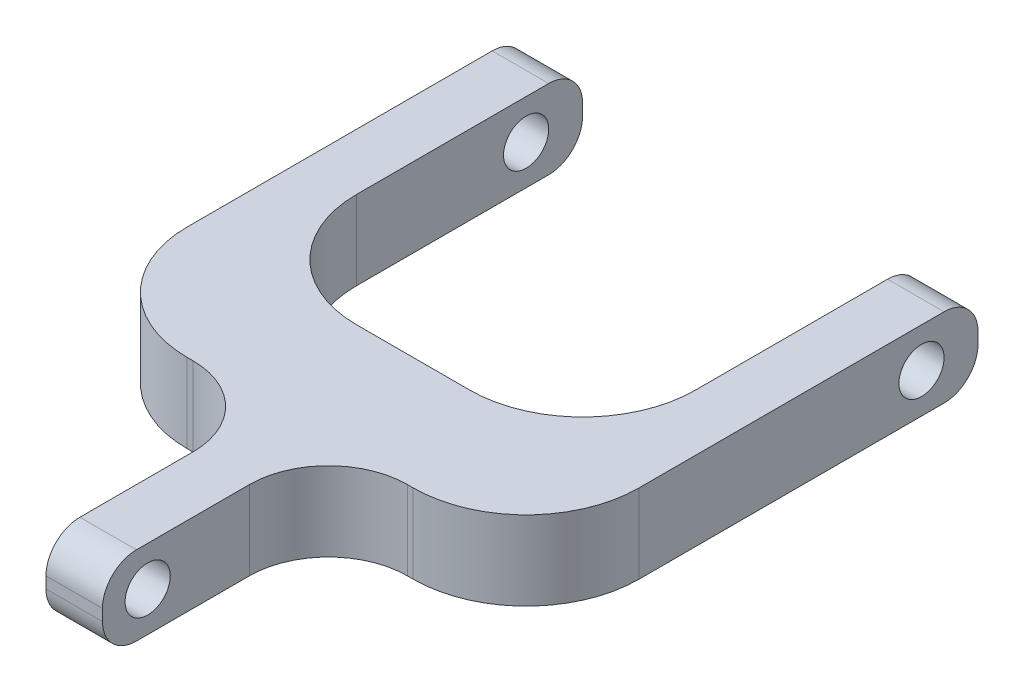
ISO-10303-21;
HEADER;
FILE_DESCRIPTION(('STEP AP214'),'2;1');
FILE_NAME('part.step','',(''),(''),'','','');
FILE_SCHEMA(('AUTOMOTIVE_DESIGN { 1 0 10303 214 1 1 1 1 }'));
ENDSEC;
DATA;
#1=APPLICATION_CONTEXT('core data for automotive mechanical design processes');
#2=APPLICATION_PROTOCOL_DEFINITION('international standard','automotive_design',2000,#1);
#3=PRODUCT_CONTEXT('',#1,'mechanical');
#4=PRODUCT('Part','Part','',(#3));
#5=PRODUCT_RELATED_PRODUCT_CATEGORY('part','',(#4));
#6=PRODUCT_DEFINITION_FORMATION('','',#4);
#7=PRODUCT_DEFINITION_CONTEXT('part definition',#1,'design');
#8=PRODUCT_DEFINITION('design','',#6,#7);
#9=PRODUCT_DEFINITION_SHAPE('','',#8);
#10=(LENGTH_UNIT() NAMED_UNIT(*) SI_UNIT(.MILLI.,.METRE.));
#11=(NAMED_UNIT(*) PLANE_ANGLE_UNIT() SI_UNIT($,.RADIAN.));
#12=(NAMED_UNIT(*) SI_UNIT($,.STERADIAN.) SOLID_ANGLE_UNIT());
#13=UNCERTAINTY_MEASURE_WITH_UNIT(LENGTH_MEASURE(1.E-05),#10,'distance_accuracy_value','');
#14=(GEOMETRIC_REPRESENTATION_CONTEXT(3) GLOBAL_UNCERTAINTY_ASSIGNED_CONTEXT((#13)) GLOBAL_UNIT_ASSIGNED_CONTEXT((#10,
#11,#12)) REPRESENTATION_CONTEXT('',''));
#15=CARTESIAN_POINT('',(0.,0.,0.));
#16=DIRECTION('',(0.,0.,1.));
#17=DIRECTION('',(1.,0.,0.));
#18=AXIS2_PLACEMENT_3D('',#15,#16,#17);
#19=CARTESIAN_POINT('',(40.,3.5,20.));
#20=DIRECTION('',(0.,0.,-1.));
#21=DIRECTION('',(-1.,0.,0.));
#22=AXIS2_PLACEMENT_3D('',#19,#20,#21);
#23=PLANE('',#22);
#24=DIRECTION('',(-1.,0.,0.));
#25=VECTOR('',#24,1.);
#26=CARTESIAN_POINT('',(40.,-3.5,20.));
#27=LINE('',#26,#25);
#28=CARTESIAN_POINT('',(10.5,-3.5,20.));
#29=VERTEX_POINT('',#28);
#30=CARTESIAN_POINT('',(10.,-3.5,20.));
#31=VERTEX_POINT('',#30);
#32=EDGE_CURVE('E291',#29,#31,#27,.T.);
#33=ORIENTED_EDGE('',*,*,#32,.F.);
#34=DIRECTION('',(0.,-1.,0.));
#35=VECTOR('',#34,1.);
#36=CARTESIAN_POINT('',(10.5,3.5,20.));
#37=LINE('',#36,#35);
#38=CARTESIAN_POINT('',(10.5,3.5,20.));
#39=VERTEX_POINT('',#38);
#40=EDGE_CURVE('E349',#29,#39,#37,.F.);
#41=ORIENTED_EDGE('',*,*,#40,.T.);
#42=DIRECTION('',(-1.,0.,0.));
#43=VECTOR('',#42,1.);
#44=CARTESIAN_POINT('',(40.,3.5,20.));
#45=LINE('',#44,#43);
#46=CARTESIAN_POINT('',(10.,3.5,20.));
#47=VERTEX_POINT('',#46);
#48=EDGE_CURVE('E304',#39,#47,#45,.T.);
#49=ORIENTED_EDGE('',*,*,#48,.T.);
#50=DIRECTION('',(0.,-1.,0.));
#51=VECTOR('',#50,1.);
#52=CARTESIAN_POINT('',(10.,3.5,20.));
#53=LINE('',#52,#51);
#54=EDGE_CURVE('E319',#47,#31,#53,.T.);
#55=ORIENTED_EDGE('',*,*,#54,.T.);
#56=EDGE_LOOP('',(#33,#41,#49,#55));
#57=FACE_BOUND('',#56,.T.);
#58=ADVANCED_FACE('F42',(#57),#23,.F.);
#59=CARTESIAN_POINT('',(30.,3.5,20.));
#60=VERTEX_POINT('',#59);
#61=CARTESIAN_POINT('',(29.5,3.5,20.));
#62=VERTEX_POINT('',#61);
#63=EDGE_CURVE('E305',#60,#62,#45,.T.);
#64=ORIENTED_EDGE('',*,*,#63,.T.);
#65=DIRECTION('',(0.,1.,0.));
#66=VECTOR('',#65,1.);
#67=CARTESIAN_POINT('',(29.5,-3.5,20.));
#68=LINE('',#67,#66);
#69=CARTESIAN_POINT('',(29.5,-3.5,20.));
#70=VERTEX_POINT('',#69);
#71=EDGE_CURVE('E342',#62,#70,#68,.F.);
#72=ORIENTED_EDGE('',*,*,#71,.T.);
#73=CARTESIAN_POINT('',(30.,-3.5,20.));
#74=VERTEX_POINT('',#73);
#75=EDGE_CURVE('E300',#74,#70,#27,.T.);
#76=ORIENTED_EDGE('',*,*,#75,.F.);
#77=DIRECTION('',(0.,-1.,0.));
#78=VECTOR('',#77,1.);
#79=CARTESIAN_POINT('',(30.,3.5,20.));
#80=LINE('',#79,#78);
#81=EDGE_CURVE('E323',#74,#60,#80,.F.);
#82=ORIENTED_EDGE('',*,*,#81,.T.);
#83=EDGE_LOOP('',(#64,#72,#76,#82));
#84=FACE_BOUND('',#83,.T.);
#85=ADVANCED_FACE('F476',(#84),#23,.F.);
#86=CARTESIAN_POINT('',(40.,3.5,-20.));
#87=DIRECTION('',(0.,0.,1.));
#88=DIRECTION('',(1.,0.,0.));
#89=AXIS2_PLACEMENT_3D('',#86,#87,#88);
#90=PLANE('',#89);
#91=DIRECTION('',(0.,1.,0.));
#92=VECTOR('',#91,1.);
#93=CARTESIAN_POINT('',(5.,-3.5,-20.));
#94=LINE('',#93,#92);
#95=CARTESIAN_POINT('',(5.,-0.5,-20.));
#96=VERTEX_POINT('',#95);
#97=CARTESIAN_POINT('',(5.,0.5,-20.));
#98=VERTEX_POINT('',#97);
#99=EDGE_CURVE('E265',#96,#98,#94,.T.);
#100=ORIENTED_EDGE('',*,*,#99,.F.);
#101=DIRECTION('',(-1.,0.,0.));
#102=VECTOR('',#101,1.);
#103=CARTESIAN_POINT('',(40.,-0.5,-20.));
#104=LINE('',#103,#102);
#105=CARTESIAN_POINT('',(0.,-0.5,-20.));
#106=VERTEX_POINT('',#105);
#107=EDGE_CURVE('E408',#96,#106,#104,.T.);
#108=ORIENTED_EDGE('',*,*,#107,.T.);
#109=DIRECTION('',(0.,1.,0.));
#110=VECTOR('',#109,1.);
#111=CARTESIAN_POINT('',(0.,3.5,-20.));
#112=LINE('',#111,#110);
#113=CARTESIAN_POINT('',(0.,0.5,-20.));
#114=VERTEX_POINT('',#113);
#115=EDGE_CURVE('E269',#106,#114,#112,.T.);
#116=ORIENTED_EDGE('',*,*,#115,.T.);
#117=DIRECTION('',(-1.,0.,0.));
#118=VECTOR('',#117,1.);
#119=CARTESIAN_POINT('',(40.,0.5,-20.));
#120=LINE('',#119,#118);
#121=EDGE_CURVE('E405',#114,#98,#120,.F.);
#122=ORIENTED_EDGE('',*,*,#121,.T.);
#123=EDGE_LOOP('',(#100,#108,#116,#122));
#124=FACE_BOUND('',#123,.T.);
#125=ADVANCED_FACE('F482',(#124),#90,.F.);
#126=DIRECTION('',(0.,1.,0.));
#127=VECTOR('',#126,1.);
#128=CARTESIAN_POINT('',(40.,3.5,-20.));
#129=LINE('',#128,#127);
#130=CARTESIAN_POINT('',(40.,-0.5,-20.));
#131=VERTEX_POINT('',#130);
#132=CARTESIAN_POINT('',(40.,0.5,-20.));
#133=VERTEX_POINT('',#132);
#134=EDGE_CURVE('E281',#131,#133,#129,.T.);
#135=ORIENTED_EDGE('',*,*,#134,.F.);
#136=DIRECTION('',(-1.,0.,0.));
#137=VECTOR('',#136,1.);
#138=CARTESIAN_POINT('',(40.,-0.5,-20.));
#139=LINE('',#138,#137);
#140=CARTESIAN_POINT('',(35.,-0.5,-20.));
#141=VERTEX_POINT('',#140);
#142=EDGE_CURVE('E426',#131,#141,#139,.T.);
#143=ORIENTED_EDGE('',*,*,#142,.T.);
#144=DIRECTION('',(0.,1.,0.));
#145=VECTOR('',#144,1.);
#146=CARTESIAN_POINT('',(35.,-3.5,-20.));
#147=LINE('',#146,#145);
#148=CARTESIAN_POINT('',(35.,0.5,-20.));
#149=VERTEX_POINT('',#148);
#150=EDGE_CURVE('E270',#141,#149,#147,.T.);
#151=ORIENTED_EDGE('',*,*,#150,.T.);
#152=DIRECTION('',(-1.,0.,0.));
#153=VECTOR('',#152,1.);
#154=CARTESIAN_POINT('',(40.,0.5,-20.));
#155=LINE('',#154,#153);
#156=EDGE_CURVE('E59',#149,#133,#155,.F.);
#157=ORIENTED_EDGE('',*,*,#156,.T.);
#158=EDGE_LOOP('',(#135,#143,#151,#157));
#159=FACE_BOUND('',#158,.T.);
#160=ADVANCED_FACE('F452',(#159),#90,.F.);
#161=CARTESIAN_POINT('',(40.,3.5,20.));
#162=DIRECTION('',(0.,-1.,0.));
#163=DIRECTION('',(0.,0.,-1.));
#164=AXIS2_PLACEMENT_3D('',#161,#162,#163);
#165=PLANE('',#164);
#166=DIRECTION('',(0.,0.,-1.));
#167=VECTOR('',#166,1.);
#168=CARTESIAN_POINT('',(17.5,3.5,40.));
#169=LINE('',#168,#167);
#170=CARTESIAN_POINT('',(17.5,3.5,37.));
#171=VERTEX_POINT('',#170);
#172=CARTESIAN_POINT('',(17.5,3.5,27.));
#173=VERTEX_POINT('',#172);
#174=EDGE_CURVE('E590',#171,#173,#169,.T.);
#175=ORIENTED_EDGE('',*,*,#174,.F.);
#176=DIRECTION('',(-1.,0.,0.));
#177=VECTOR('',#176,1.);
#178=CARTESIAN_POINT('',(22.5,3.5,37.));
#179=LINE('',#178,#177);
#180=CARTESIAN_POINT('',(22.5,3.5,37.));
#181=VERTEX_POINT('',#180);
#182=EDGE_CURVE('E402',#171,#181,#179,.F.);
#183=ORIENTED_EDGE('',*,*,#182,.T.);
#184=DIRECTION('',(0.,0.,-1.));
#185=VECTOR('',#184,1.);
#186=CARTESIAN_POINT('',(22.5,3.5,40.));
#187=LINE('',#186,#185);
#188=CARTESIAN_POINT('',(22.5,3.5,27.));
#189=VERTEX_POINT('',#188);
#190=EDGE_CURVE('E593',#181,#189,#187,.T.);
#191=ORIENTED_EDGE('',*,*,#190,.T.);
#192=CARTESIAN_POINT('',(29.5,3.5,27.));
#193=DIRECTION('',(0.,-1.,0.));
#194=DIRECTION('',(0.,0.,-1.));
#195=AXIS2_PLACEMENT_3D('',#192,#193,#194);
#196=CIRCLE('',#195,7.);
#197=EDGE_CURVE('E352',#189,#62,#196,.T.);
#198=ORIENTED_EDGE('',*,*,#197,.T.);
#199=ORIENTED_EDGE('',*,*,#63,.F.);
#200=CARTESIAN_POINT('',(30.,3.5,10.));
#201=DIRECTION('',(0.,-1.,0.));
#202=DIRECTION('',(0.,0.,-1.));
#203=AXIS2_PLACEMENT_3D('',#200,#201,#202);
#204=CIRCLE('',#203,10.);
#205=CARTESIAN_POINT('',(40.,3.5,10.));
#206=VERTEX_POINT('',#205);
#207=EDGE_CURVE('E330',#60,#206,#204,.F.);
#208=ORIENTED_EDGE('',*,*,#207,.T.);
#209=DIRECTION('',(0.,0.,1.));
#210=VECTOR('',#209,1.);
#211=CARTESIAN_POINT('',(40.,3.5,20.));
#212=LINE('',#211,#210);
#213=CARTESIAN_POINT('',(40.,3.5,-17.));
#214=VERTEX_POINT('',#213);
#215=EDGE_CURVE('E284',#214,#206,#212,.T.);
#216=ORIENTED_EDGE('',*,*,#215,.F.);
#217=DIRECTION('',(-1.,0.,0.));
#218=VECTOR('',#217,1.);
#219=CARTESIAN_POINT('',(40.,3.5,-17.));
#220=LINE('',#219,#218);
#221=CARTESIAN_POINT('',(35.,3.5,-17.));
#222=VERTEX_POINT('',#221);
#223=EDGE_CURVE('E394',#214,#222,#220,.T.);
#224=ORIENTED_EDGE('',*,*,#223,.T.);
#225=DIRECTION('',(0.,0.,-1.));
#226=VECTOR('',#225,1.);
#227=CARTESIAN_POINT('',(35.,3.5,-20.));
#228=LINE('',#227,#226);
#229=CARTESIAN_POINT('',(35.,3.5,0.));
#230=VERTEX_POINT('',#229);
#231=EDGE_CURVE('E218',#230,#222,#228,.T.);
#232=ORIENTED_EDGE('',*,*,#231,.F.);
#233=CARTESIAN_POINT('',(25.,3.5,0.));
#234=DIRECTION('',(0.,1.,0.));
#235=DIRECTION('',(0.,0.,1.));
#236=AXIS2_PLACEMENT_3D('',#233,#234,#235);
#237=CIRCLE('',#236,10.);
#238=CARTESIAN_POINT('',(25.,3.5,10.));
#239=VERTEX_POINT('',#238);
#240=EDGE_CURVE('E258',#239,#230,#237,.T.);
#241=ORIENTED_EDGE('',*,*,#240,.F.);
#242=DIRECTION('',(1.,0.,0.));
#243=VECTOR('',#242,1.);
#244=CARTESIAN_POINT('',(15.,3.5,10.));
#245=LINE('',#244,#243);
#246=CARTESIAN_POINT('',(15.,3.5,10.));
#247=VERTEX_POINT('',#246);
#248=EDGE_CURVE('E254',#247,#239,#245,.T.);
#249=ORIENTED_EDGE('',*,*,#248,.F.);
#250=CARTESIAN_POINT('',(15.,3.5,0.));
#251=DIRECTION('',(0.,1.,0.));
#252=DIRECTION('',(0.,0.,1.));
#253=AXIS2_PLACEMENT_3D('',#250,#251,#252);
#254=CIRCLE('',#253,10.);
#255=CARTESIAN_POINT('',(5.,3.5,0.));
#256=VERTEX_POINT('',#255);
#257=EDGE_CURVE('E250',#256,#247,#254,.T.);
#258=ORIENTED_EDGE('',*,*,#257,.F.);
#259=DIRECTION('',(0.,0.,1.));
#260=VECTOR('',#259,1.);
#261=CARTESIAN_POINT('',(5.,3.5,-20.));
#262=LINE('',#261,#260);
#263=CARTESIAN_POINT('',(5.,3.5,-17.));
#264=VERTEX_POINT('',#263);
#265=EDGE_CURVE('E224',#264,#256,#262,.T.);
#266=ORIENTED_EDGE('',*,*,#265,.F.);
#267=DIRECTION('',(-1.,0.,0.));
#268=VECTOR('',#267,1.);
#269=CARTESIAN_POINT('',(40.,3.5,-17.));
#270=LINE('',#269,#268);
#271=CARTESIAN_POINT('',(0.,3.5,-17.));
#272=VERTEX_POINT('',#271);
#273=EDGE_CURVE('E398',#264,#272,#270,.T.);
#274=ORIENTED_EDGE('',*,*,#273,.T.);
#275=DIRECTION('',(0.,0.,1.));
#276=VECTOR('',#275,1.);
#277=CARTESIAN_POINT('',(0.,3.5,20.));
#278=LINE('',#277,#276);
#279=CARTESIAN_POINT('',(0.,3.5,10.));
#280=VERTEX_POINT('',#279);
#281=EDGE_CURVE('E295',#272,#280,#278,.T.);
#282=ORIENTED_EDGE('',*,*,#281,.T.);
#283=CARTESIAN_POINT('',(10.,3.5,10.));
#284=DIRECTION('',(0.,-1.,0.));
#285=DIRECTION('',(0.,0.,-1.));
#286=AXIS2_PLACEMENT_3D('',#283,#284,#285);
#287=CIRCLE('',#286,10.);
#288=EDGE_CURVE('E326',#280,#47,#287,.F.);
#289=ORIENTED_EDGE('',*,*,#288,.T.);
#290=ORIENTED_EDGE('',*,*,#48,.F.);
#291=CARTESIAN_POINT('',(10.5,3.5,27.));
#292=DIRECTION('',(0.,-1.,0.));
#293=DIRECTION('',(0.,0.,-1.));
#294=AXIS2_PLACEMENT_3D('',#291,#292,#293);
#295=CIRCLE('',#294,7.);
#296=EDGE_CURVE('E362',#39,#173,#295,.T.);
#297=ORIENTED_EDGE('',*,*,#296,.T.);
#298=EDGE_LOOP('',(#175,#183,#191,#198,#199,#208,#216,#224,#232,#241,#249,#258,#266,#274,#282,
#289,#290,#297));
#299=FACE_BOUND('',#298,.T.);
#300=ADVANCED_FACE('F444',(#299),#165,.F.);
#301=CARTESIAN_POINT('',(40.,-3.5,20.));
#302=DIRECTION('',(0.,1.,0.));
#303=DIRECTION('',(0.,0.,1.));
#304=AXIS2_PLACEMENT_3D('',#301,#302,#303);
#305=PLANE('',#304);
#306=DIRECTION('',(0.,0.,-1.));
#307=VECTOR('',#306,1.);
#308=CARTESIAN_POINT('',(22.5,-3.5,40.));
#309=LINE('',#308,#307);
#310=CARTESIAN_POINT('',(22.5,-3.5,37.));
#311=VERTEX_POINT('',#310);
#312=CARTESIAN_POINT('',(22.5,-3.5,27.));
#313=VERTEX_POINT('',#312);
#314=EDGE_CURVE('E596',#311,#313,#309,.T.);
#315=ORIENTED_EDGE('',*,*,#314,.F.);
#316=DIRECTION('',(1.,0.,0.));
#317=VECTOR('',#316,1.);
#318=CARTESIAN_POINT('',(17.5,-3.5,37.));
#319=LINE('',#318,#317);
#320=CARTESIAN_POINT('',(17.5,-3.5,37.));
#321=VERTEX_POINT('',#320);
#322=EDGE_CURVE('E385',#311,#321,#319,.F.);
#323=ORIENTED_EDGE('',*,*,#322,.T.);
#324=DIRECTION('',(0.,0.,-1.));
#325=VECTOR('',#324,1.);
#326=CARTESIAN_POINT('',(17.5,-3.5,40.));
#327=LINE('',#326,#325);
#328=CARTESIAN_POINT('',(17.5,-3.5,27.));
#329=VERTEX_POINT('',#328);
#330=EDGE_CURVE('E251',#321,#329,#327,.T.);
#331=ORIENTED_EDGE('',*,*,#330,.T.);
#332=CARTESIAN_POINT('',(10.5,-3.5,27.));
#333=DIRECTION('',(0.,1.,0.));
#334=DIRECTION('',(0.,0.,1.));
#335=AXIS2_PLACEMENT_3D('',#332,#333,#334);
#336=CIRCLE('',#335,7.);
#337=EDGE_CURVE('E359',#329,#29,#336,.T.);
#338=ORIENTED_EDGE('',*,*,#337,.T.);
#339=ORIENTED_EDGE('',*,*,#32,.T.);
#340=CARTESIAN_POINT('',(10.,-3.5,10.));
#341=DIRECTION('',(0.,1.,0.));
#342=DIRECTION('',(0.,0.,1.));
#343=AXIS2_PLACEMENT_3D('',#340,#341,#342);
#344=CIRCLE('',#343,10.);
#345=CARTESIAN_POINT('',(0.,-3.5,10.));
#346=VERTEX_POINT('',#345);
#347=EDGE_CURVE('E313',#31,#346,#344,.F.);
#348=ORIENTED_EDGE('',*,*,#347,.T.);
#349=DIRECTION('',(0.,0.,-1.));
#350=VECTOR('',#349,1.);
#351=CARTESIAN_POINT('',(0.,-3.5,20.));
#352=LINE('',#351,#350);
#353=CARTESIAN_POINT('',(0.,-3.5,-17.));
#354=VERTEX_POINT('',#353);
#355=EDGE_CURVE('E285',#346,#354,#352,.T.);
#356=ORIENTED_EDGE('',*,*,#355,.T.);
#357=DIRECTION('',(-1.,0.,0.));
#358=VECTOR('',#357,1.);
#359=CARTESIAN_POINT('',(40.,-3.5,-17.));
#360=LINE('',#359,#358);
#361=CARTESIAN_POINT('',(5.,-3.5,-17.));
#362=VERTEX_POINT('',#361);
#363=EDGE_CURVE('E214',#354,#362,#360,.F.);
#364=ORIENTED_EDGE('',*,*,#363,.T.);
#365=DIRECTION('',(0.,0.,1.));
#366=VECTOR('',#365,1.);
#367=CARTESIAN_POINT('',(5.,-3.5,-20.));
#368=LINE('',#367,#366);
#369=CARTESIAN_POINT('',(5.,-3.5,0.));
#370=VERTEX_POINT('',#369);
#371=EDGE_CURVE('E205',#362,#370,#368,.T.);
#372=ORIENTED_EDGE('',*,*,#371,.T.);
#373=CARTESIAN_POINT('',(15.,-3.5,0.));
#374=DIRECTION('',(0.,1.,0.));
#375=DIRECTION('',(0.,0.,1.));
#376=AXIS2_PLACEMENT_3D('',#373,#374,#375);
#377=CIRCLE('',#376,10.);
#378=CARTESIAN_POINT('',(15.,-3.5,10.));
#379=VERTEX_POINT('',#378);
#380=EDGE_CURVE('E211',#370,#379,#377,.T.);
#381=ORIENTED_EDGE('',*,*,#380,.T.);
#382=DIRECTION('',(1.,0.,0.));
#383=VECTOR('',#382,1.);
#384=CARTESIAN_POINT('',(15.,-3.5,10.));
#385=LINE('',#384,#383);
#386=CARTESIAN_POINT('',(25.,-3.5,10.));
#387=VERTEX_POINT('',#386);
#388=EDGE_CURVE('E235',#379,#387,#385,.T.);
#389=ORIENTED_EDGE('',*,*,#388,.T.);
#390=CARTESIAN_POINT('',(25.,-3.5,0.));
#391=DIRECTION('',(0.,1.,0.));
#392=DIRECTION('',(0.,0.,1.));
#393=AXIS2_PLACEMENT_3D('',#390,#391,#392);
#394=CIRCLE('',#393,10.);
#395=CARTESIAN_POINT('',(35.,-3.5,0.));
#396=VERTEX_POINT('',#395);
#397=EDGE_CURVE('E238',#387,#396,#394,.T.);
#398=ORIENTED_EDGE('',*,*,#397,.T.);
#399=DIRECTION('',(0.,0.,-1.));
#400=VECTOR('',#399,1.);
#401=CARTESIAN_POINT('',(35.,-3.5,-20.));
#402=LINE('',#401,#400);
#403=CARTESIAN_POINT('',(35.,-3.5,-17.));
#404=VERTEX_POINT('',#403);
#405=EDGE_CURVE('E230',#396,#404,#402,.T.);
#406=ORIENTED_EDGE('',*,*,#405,.T.);
#407=DIRECTION('',(-1.,0.,0.));
#408=VECTOR('',#407,1.);
#409=CARTESIAN_POINT('',(40.,-3.5,-17.));
#410=LINE('',#409,#408);
#411=CARTESIAN_POINT('',(40.,-3.5,-17.));
#412=VERTEX_POINT('',#411);
#413=EDGE_CURVE('E380',#404,#412,#410,.F.);
#414=ORIENTED_EDGE('',*,*,#413,.T.);
#415=DIRECTION('',(0.,0.,-1.));
#416=VECTOR('',#415,1.);
#417=CARTESIAN_POINT('',(40.,-3.5,20.));
#418=LINE('',#417,#416);
#419=CARTESIAN_POINT('',(40.,-3.5,10.));
#420=VERTEX_POINT('',#419);
#421=EDGE_CURVE('E288',#420,#412,#418,.T.);
#422=ORIENTED_EDGE('',*,*,#421,.F.);
#423=CARTESIAN_POINT('',(30.,-3.5,10.));
#424=DIRECTION('',(0.,1.,0.));
#425=DIRECTION('',(0.,0.,1.));
#426=AXIS2_PLACEMENT_3D('',#423,#424,#425);
#427=CIRCLE('',#426,10.);
#428=EDGE_CURVE('E316',#420,#74,#427,.F.);
#429=ORIENTED_EDGE('',*,*,#428,.T.);
#430=ORIENTED_EDGE('',*,*,#75,.T.);
#431=CARTESIAN_POINT('',(29.5,-3.5,27.));
#432=DIRECTION('',(0.,1.,0.));
#433=DIRECTION('',(0.,0.,1.));
#434=AXIS2_PLACEMENT_3D('',#431,#432,#433);
#435=CIRCLE('',#434,7.);
#436=EDGE_CURVE('E355',#70,#313,#435,.T.);
#437=ORIENTED_EDGE('',*,*,#436,.T.);
#438=EDGE_LOOP('',(#315,#323,#331,#338,#339,#348,#356,#364,#372,#381,#389,#398,#406,#414,#422,
#429,#430,#437));
#439=FACE_BOUND('',#438,.T.);
#440=ADVANCED_FACE('F208',(#439),#305,.F.);
#441=CARTESIAN_POINT('',(40.,0.,0.));
#442=DIRECTION('',(1.,0.,0.));
#443=DIRECTION('',(0.,0.,-1.));
#444=AXIS2_PLACEMENT_3D('',#441,#442,#443);
#445=PLANE('',#444);
#446=CARTESIAN_POINT('',(40.,0.,-15.));
#447=DIRECTION('',(1.,0.,0.));
#448=DIRECTION('',(0.,0.,-1.));
#449=AXIS2_PLACEMENT_3D('',#446,#447,#448);
#450=CIRCLE('',#449,2.);
#451=CARTESIAN_POINT('',(40.,0.,-17.));
#452=VERTEX_POINT('',#451);
#453=EDGE_CURVE('E573',#452,#452,#450,.T.);
#454=ORIENTED_EDGE('',*,*,#453,.F.);
#455=EDGE_LOOP('',(#454));
#456=FACE_BOUND('',#455,.T.);
#457=ORIENTED_EDGE('',*,*,#421,.T.);
#458=CARTESIAN_POINT('',(40.,-0.5,-17.));
#459=DIRECTION('',(1.,0.,0.));
#460=DIRECTION('',(0.,0.,-1.));
#461=AXIS2_PLACEMENT_3D('',#458,#459,#460);
#462=CIRCLE('',#461,3.);
#463=EDGE_CURVE('E11',#412,#131,#462,.T.);
#464=ORIENTED_EDGE('',*,*,#463,.T.);
#465=ORIENTED_EDGE('',*,*,#134,.T.);
#466=CARTESIAN_POINT('',(40.,0.5,-17.));
#467=DIRECTION('',(1.,0.,0.));
#468=DIRECTION('',(0.,0.,-1.));
#469=AXIS2_PLACEMENT_3D('',#466,#467,#468);
#470=CIRCLE('',#469,3.);
#471=EDGE_CURVE('E52',#133,#214,#470,.T.);
#472=ORIENTED_EDGE('',*,*,#471,.T.);
#473=ORIENTED_EDGE('',*,*,#215,.T.);
#474=DIRECTION('',(0.,-1.,0.));
#475=VECTOR('',#474,1.);
#476=CARTESIAN_POINT('',(40.,-3.5,10.));
#477=LINE('',#476,#475);
#478=EDGE_CURVE('E309',#206,#420,#477,.T.);
#479=ORIENTED_EDGE('',*,*,#478,.T.);
#480=EDGE_LOOP('',(#457,#464,#465,#472,#473,#479));
#481=FACE_BOUND('',#480,.T.);
#482=ADVANCED_FACE('F439',(#456,#481),#445,.T.);
#483=CARTESIAN_POINT('',(0.,0.,0.));
#484=DIRECTION('',(1.,0.,0.));
#485=DIRECTION('',(0.,0.,-1.));
#486=AXIS2_PLACEMENT_3D('',#483,#484,#485);
#487=PLANE('',#486);
#488=CARTESIAN_POINT('',(0.,0.,-15.));
#489=DIRECTION('',(1.,0.,0.));
#490=DIRECTION('',(0.,0.,-1.));
#491=AXIS2_PLACEMENT_3D('',#488,#489,#490);
#492=CIRCLE('',#491,2.);
#493=CARTESIAN_POINT('',(0.,0.,-17.));
#494=VERTEX_POINT('',#493);
#495=EDGE_CURVE('E566',#494,#494,#492,.T.);
#496=ORIENTED_EDGE('',*,*,#495,.T.);
#497=EDGE_LOOP('',(#496));
#498=FACE_BOUND('',#497,.T.);
#499=ORIENTED_EDGE('',*,*,#115,.F.);
#500=CARTESIAN_POINT('',(0.,-0.5,-17.));
#501=DIRECTION('',(1.,0.,0.));
#502=DIRECTION('',(0.,0.,-1.));
#503=AXIS2_PLACEMENT_3D('',#500,#501,#502);
#504=CIRCLE('',#503,3.);
#505=EDGE_CURVE('E415',#106,#354,#504,.F.);
#506=ORIENTED_EDGE('',*,*,#505,.T.);
#507=ORIENTED_EDGE('',*,*,#355,.F.);
#508=DIRECTION('',(0.,-1.,0.));
#509=VECTOR('',#508,1.);
#510=CARTESIAN_POINT('',(0.,0.,10.));
#511=LINE('',#510,#509);
#512=EDGE_CURVE('E334',#346,#280,#511,.F.);
#513=ORIENTED_EDGE('',*,*,#512,.T.);
#514=ORIENTED_EDGE('',*,*,#281,.F.);
#515=CARTESIAN_POINT('',(0.,0.5,-17.));
#516=DIRECTION('',(1.,0.,0.));
#517=DIRECTION('',(0.,0.,-1.));
#518=AXIS2_PLACEMENT_3D('',#515,#516,#517);
#519=CIRCLE('',#518,3.);
#520=EDGE_CURVE('E412',#272,#114,#519,.F.);
#521=ORIENTED_EDGE('',*,*,#520,.T.);
#522=EDGE_LOOP('',(#499,#506,#507,#513,#514,#521));
#523=FACE_BOUND('',#522,.T.);
#524=ADVANCED_FACE('F559',(#498,#523),#487,.F.);
#525=CARTESIAN_POINT('',(5.,-3.5,-20.));
#526=DIRECTION('',(-1.,0.,0.));
#527=DIRECTION('',(0.,0.,1.));
#528=AXIS2_PLACEMENT_3D('',#525,#526,#527);
#529=PLANE('',#528);
#530=CARTESIAN_POINT('',(5.,0.,-15.));
#531=DIRECTION('',(-1.,0.,0.));
#532=DIRECTION('',(0.,0.,1.));
#533=AXIS2_PLACEMENT_3D('',#530,#531,#532);
#534=CIRCLE('',#533,2.);
#535=CARTESIAN_POINT('',(5.,0.,-13.));
#536=VERTEX_POINT('',#535);
#537=EDGE_CURVE('E565',#536,#536,#534,.T.);
#538=ORIENTED_EDGE('',*,*,#537,.T.);
#539=EDGE_LOOP('',(#538));
#540=FACE_BOUND('',#539,.T.);
#541=ORIENTED_EDGE('',*,*,#371,.F.);
#542=CARTESIAN_POINT('',(5.,-0.5,-17.));
#543=DIRECTION('',(-1.,0.,0.));
#544=DIRECTION('',(0.,0.,1.));
#545=AXIS2_PLACEMENT_3D('',#542,#543,#544);
#546=CIRCLE('',#545,3.);
#547=EDGE_CURVE('E421',#362,#96,#546,.F.);
#548=ORIENTED_EDGE('',*,*,#547,.T.);
#549=ORIENTED_EDGE('',*,*,#99,.T.);
#550=CARTESIAN_POINT('',(5.,0.5,-17.));
#551=DIRECTION('',(-1.,0.,0.));
#552=DIRECTION('',(0.,0.,1.));
#553=AXIS2_PLACEMENT_3D('',#550,#551,#552);
#554=CIRCLE('',#553,3.);
#555=EDGE_CURVE('E418',#98,#264,#554,.F.);
#556=ORIENTED_EDGE('',*,*,#555,.T.);
#557=ORIENTED_EDGE('',*,*,#265,.T.);
#558=DIRECTION('',(0.,1.,0.));
#559=VECTOR('',#558,1.);
#560=CARTESIAN_POINT('',(5.,-3.5,0.));
#561=LINE('',#560,#559);
#562=EDGE_CURVE('E221',#370,#256,#561,.T.);
#563=ORIENTED_EDGE('',*,*,#562,.F.);
#564=EDGE_LOOP('',(#541,#548,#549,#556,#557,#563));
#565=FACE_BOUND('',#564,.T.);
#566=ADVANCED_FACE('F222',(#540,#565),#529,.F.);
#567=CARTESIAN_POINT('',(35.,-3.5,-20.));
#568=DIRECTION('',(1.,0.,0.));
#569=DIRECTION('',(0.,0.,-1.));
#570=AXIS2_PLACEMENT_3D('',#567,#568,#569);
#571=PLANE('',#570);
#572=CARTESIAN_POINT('',(35.,0.,-15.));
#573=DIRECTION('',(1.,0.,0.));
#574=DIRECTION('',(0.,0.,-1.));
#575=AXIS2_PLACEMENT_3D('',#572,#573,#574);
#576=CIRCLE('',#575,2.);
#577=CARTESIAN_POINT('',(35.,0.,-17.));
#578=VERTEX_POINT('',#577);
#579=EDGE_CURVE('E46',#578,#578,#576,.T.);
#580=ORIENTED_EDGE('',*,*,#579,.T.);
#581=EDGE_LOOP('',(#580));
#582=FACE_BOUND('',#581,.T.);
#583=ORIENTED_EDGE('',*,*,#150,.F.);
#584=CARTESIAN_POINT('',(35.,-0.5,-17.));
#585=DIRECTION('',(1.,0.,0.));
#586=DIRECTION('',(0.,0.,-1.));
#587=AXIS2_PLACEMENT_3D('',#584,#585,#586);
#588=CIRCLE('',#587,3.);
#589=EDGE_CURVE('E433',#141,#404,#588,.F.);
#590=ORIENTED_EDGE('',*,*,#589,.T.);
#591=ORIENTED_EDGE('',*,*,#405,.F.);
#592=DIRECTION('',(0.,1.,0.));
#593=VECTOR('',#592,1.);
#594=CARTESIAN_POINT('',(35.,-3.5,0.));
#595=LINE('',#594,#593);
#596=EDGE_CURVE('E273',#396,#230,#595,.T.);
#597=ORIENTED_EDGE('',*,*,#596,.T.);
#598=ORIENTED_EDGE('',*,*,#231,.T.);
#599=CARTESIAN_POINT('',(35.,0.5,-17.));
#600=DIRECTION('',(1.,0.,0.));
#601=DIRECTION('',(0.,0.,-1.));
#602=AXIS2_PLACEMENT_3D('',#599,#600,#601);
#603=CIRCLE('',#602,3.);
#604=EDGE_CURVE('E430',#222,#149,#603,.F.);
#605=ORIENTED_EDGE('',*,*,#604,.T.);
#606=EDGE_LOOP('',(#583,#590,#591,#597,#598,#605));
#607=FACE_BOUND('',#606,.T.);
#608=ADVANCED_FACE('F451',(#582,#607),#571,.F.);
#609=CARTESIAN_POINT('',(25.,-3.5,0.));
#610=DIRECTION('',(0.,1.,0.));
#611=DIRECTION('',(0.,0.,1.));
#612=AXIS2_PLACEMENT_3D('',#609,#610,#611);
#613=CYLINDRICAL_SURFACE('',#612,10.);
#614=ORIENTED_EDGE('',*,*,#240,.T.);
#615=ORIENTED_EDGE('',*,*,#596,.F.);
#616=ORIENTED_EDGE('',*,*,#397,.F.);
#617=DIRECTION('',(0.,1.,0.));
#618=VECTOR('',#617,1.);
#619=CARTESIAN_POINT('',(25.,-3.5,10.));
#620=LINE('',#619,#618);
#621=EDGE_CURVE('E276',#387,#239,#620,.T.);
#622=ORIENTED_EDGE('',*,*,#621,.T.);
#623=EDGE_LOOP('',(#614,#615,#616,#622));
#624=FACE_BOUND('',#623,.T.);
#625=ADVANCED_FACE('F461',(#624),#613,.F.);
#626=CARTESIAN_POINT('',(15.,-3.5,10.));
#627=DIRECTION('',(0.,0.,1.));
#628=DIRECTION('',(1.,0.,0.));
#629=AXIS2_PLACEMENT_3D('',#626,#627,#628);
#630=PLANE('',#629);
#631=ORIENTED_EDGE('',*,*,#248,.T.);
#632=ORIENTED_EDGE('',*,*,#621,.F.);
#633=ORIENTED_EDGE('',*,*,#388,.F.);
#634=DIRECTION('',(0.,1.,0.));
#635=VECTOR('',#634,1.);
#636=CARTESIAN_POINT('',(15.,-3.5,10.));
#637=LINE('',#636,#635);
#638=EDGE_CURVE('E229',#379,#247,#637,.T.);
#639=ORIENTED_EDGE('',*,*,#638,.T.);
#640=EDGE_LOOP('',(#631,#632,#633,#639));
#641=FACE_BOUND('',#640,.T.);
#642=ADVANCED_FACE('F465',(#641),#630,.F.);
#643=CARTESIAN_POINT('',(15.,-3.5,0.));
#644=DIRECTION('',(0.,1.,0.));
#645=DIRECTION('',(0.,0.,1.));
#646=AXIS2_PLACEMENT_3D('',#643,#644,#645);
#647=CYLINDRICAL_SURFACE('',#646,10.);
#648=ORIENTED_EDGE('',*,*,#257,.T.);
#649=ORIENTED_EDGE('',*,*,#638,.F.);
#650=ORIENTED_EDGE('',*,*,#380,.F.);
#651=ORIENTED_EDGE('',*,*,#562,.T.);
#652=EDGE_LOOP('',(#648,#649,#650,#651));
#653=FACE_BOUND('',#652,.T.);
#654=ADVANCED_FACE('F233',(#653),#647,.F.);
#655=CARTESIAN_POINT('',(30.,0.,10.));
#656=DIRECTION('',(0.,1.,0.));
#657=DIRECTION('',(0.,0.,1.));
#658=AXIS2_PLACEMENT_3D('',#655,#656,#657);
#659=CYLINDRICAL_SURFACE('',#658,10.);
#660=ORIENTED_EDGE('',*,*,#207,.F.);
#661=ORIENTED_EDGE('',*,*,#81,.F.);
#662=ORIENTED_EDGE('',*,*,#428,.F.);
#663=ORIENTED_EDGE('',*,*,#478,.F.);
#664=EDGE_LOOP('',(#660,#661,#662,#663));
#665=FACE_BOUND('',#664,.T.);
#666=ADVANCED_FACE('F472',(#665),#659,.T.);
#667=CARTESIAN_POINT('',(10.,3.5,10.));
#668=DIRECTION('',(0.,-1.,0.));
#669=DIRECTION('',(0.,0.,-1.));
#670=AXIS2_PLACEMENT_3D('',#667,#668,#669);
#671=CYLINDRICAL_SURFACE('',#670,10.);
#672=ORIENTED_EDGE('',*,*,#288,.F.);
#673=ORIENTED_EDGE('',*,*,#512,.F.);
#674=ORIENTED_EDGE('',*,*,#347,.F.);
#675=ORIENTED_EDGE('',*,*,#54,.F.);
#676=EDGE_LOOP('',(#672,#673,#674,#675));
#677=FACE_BOUND('',#676,.T.);
#678=ADVANCED_FACE('F494',(#677),#671,.T.);
#679=CARTESIAN_POINT('',(17.5,3.5,40.));
#680=DIRECTION('',(1.,0.,0.));
#681=DIRECTION('',(0.,0.,-1.));
#682=AXIS2_PLACEMENT_3D('',#679,#680,#681);
#683=PLANE('',#682);
#684=CARTESIAN_POINT('',(17.5,0.,36.));
#685=DIRECTION('',(1.,0.,0.));
#686=DIRECTION('',(0.,0.,-1.));
#687=AXIS2_PLACEMENT_3D('',#684,#685,#686);
#688=CIRCLE('',#687,2.);
#689=CARTESIAN_POINT('',(17.5,0.,34.));
#690=VERTEX_POINT('',#689);
#691=EDGE_CURVE('E578',#690,#690,#688,.T.);
#692=ORIENTED_EDGE('',*,*,#691,.T.);
#693=EDGE_LOOP('',(#692));
#694=FACE_BOUND('',#693,.T.);
#695=ORIENTED_EDGE('',*,*,#330,.F.);
#696=CARTESIAN_POINT('',(17.5,-0.5,37.));
#697=DIRECTION('',(1.,0.,0.));
#698=DIRECTION('',(0.,0.,-1.));
#699=AXIS2_PLACEMENT_3D('',#696,#697,#698);
#700=CIRCLE('',#699,3.);
#701=CARTESIAN_POINT('',(17.5,-0.5,40.));
#702=VERTEX_POINT('',#701);
#703=EDGE_CURVE('E391',#321,#702,#700,.F.);
#704=ORIENTED_EDGE('',*,*,#703,.T.);
#705=DIRECTION('',(0.,-1.,0.));
#706=VECTOR('',#705,1.);
#707=CARTESIAN_POINT('',(17.5,3.5,40.));
#708=LINE('',#707,#706);
#709=CARTESIAN_POINT('',(17.5,0.5,40.));
#710=VERTEX_POINT('',#709);
#711=EDGE_CURVE('E570',#710,#702,#708,.T.);
#712=ORIENTED_EDGE('',*,*,#711,.F.);
#713=CARTESIAN_POINT('',(17.5,0.5,37.));
#714=DIRECTION('',(1.,0.,0.));
#715=DIRECTION('',(0.,0.,-1.));
#716=AXIS2_PLACEMENT_3D('',#713,#714,#715);
#717=CIRCLE('',#716,3.);
#718=EDGE_CURVE('E388',#710,#171,#717,.F.);
#719=ORIENTED_EDGE('',*,*,#718,.T.);
#720=ORIENTED_EDGE('',*,*,#174,.T.);
#721=DIRECTION('',(0.,-1.,0.));
#722=VECTOR('',#721,1.);
#723=CARTESIAN_POINT('',(17.5,-3.5,27.));
#724=LINE('',#723,#722);
#725=EDGE_CURVE('E345',#173,#329,#724,.T.);
#726=ORIENTED_EDGE('',*,*,#725,.T.);
#727=EDGE_LOOP('',(#695,#704,#712,#719,#720,#726));
#728=FACE_BOUND('',#727,.T.);
#729=ADVANCED_FACE('F498',(#694,#728),#683,.F.);
#730=CARTESIAN_POINT('',(22.5,3.5,40.));
#731=DIRECTION('',(-1.,0.,0.));
#732=DIRECTION('',(0.,0.,1.));
#733=AXIS2_PLACEMENT_3D('',#730,#731,#732);
#734=PLANE('',#733);
#735=CARTESIAN_POINT('',(22.5,0.,36.));
#736=DIRECTION('',(1.,0.,0.));
#737=DIRECTION('',(0.,0.,-1.));
#738=AXIS2_PLACEMENT_3D('',#735,#736,#737);
#739=CIRCLE('',#738,2.);
#740=CARTESIAN_POINT('',(22.5,0.,34.));
#741=VERTEX_POINT('',#740);
#742=EDGE_CURVE('E863',#741,#741,#739,.T.);
#743=ORIENTED_EDGE('',*,*,#742,.F.);
#744=EDGE_LOOP('',(#743));
#745=FACE_BOUND('',#744,.T.);
#746=DIRECTION('',(0.,1.,0.));
#747=VECTOR('',#746,1.);
#748=CARTESIAN_POINT('',(22.5,3.5,40.));
#749=LINE('',#748,#747);
#750=CARTESIAN_POINT('',(22.5,-0.5,40.));
#751=VERTEX_POINT('',#750);
#752=CARTESIAN_POINT('',(22.5,0.5,40.));
#753=VERTEX_POINT('',#752);
#754=EDGE_CURVE('E586',#751,#753,#749,.T.);
#755=ORIENTED_EDGE('',*,*,#754,.F.);
#756=CARTESIAN_POINT('',(22.5,-0.5,37.));
#757=DIRECTION('',(-1.,0.,0.));
#758=DIRECTION('',(0.,0.,1.));
#759=AXIS2_PLACEMENT_3D('',#756,#757,#758);
#760=CIRCLE('',#759,3.);
#761=EDGE_CURVE('E377',#751,#311,#760,.F.);
#762=ORIENTED_EDGE('',*,*,#761,.T.);
#763=ORIENTED_EDGE('',*,*,#314,.T.);
#764=DIRECTION('',(0.,1.,0.));
#765=VECTOR('',#764,1.);
#766=CARTESIAN_POINT('',(22.5,3.5,27.));
#767=LINE('',#766,#765);
#768=EDGE_CURVE('E338',#313,#189,#767,.T.);
#769=ORIENTED_EDGE('',*,*,#768,.T.);
#770=ORIENTED_EDGE('',*,*,#190,.F.);
#771=CARTESIAN_POINT('',(22.5,0.5,37.));
#772=DIRECTION('',(-1.,0.,0.));
#773=DIRECTION('',(0.,0.,1.));
#774=AXIS2_PLACEMENT_3D('',#771,#772,#773);
#775=CIRCLE('',#774,3.);
#776=EDGE_CURVE('E374',#181,#753,#775,.F.);
#777=ORIENTED_EDGE('',*,*,#776,.T.);
#778=EDGE_LOOP('',(#755,#762,#763,#769,#770,#777));
#779=FACE_BOUND('',#778,.T.);
#780=ADVANCED_FACE('F546',(#745,#779),#734,.F.);
#781=CARTESIAN_POINT('',(0.,0.,40.));
#782=DIRECTION('',(0.,0.,1.));
#783=DIRECTION('',(1.,0.,0.));
#784=AXIS2_PLACEMENT_3D('',#781,#782,#783);
#785=PLANE('',#784);
#786=ORIENTED_EDGE('',*,*,#711,.T.);
#787=DIRECTION('',(1.,0.,0.));
#788=VECTOR('',#787,1.);
#789=CARTESIAN_POINT('',(22.5,-0.5,40.));
#790=LINE('',#789,#788);
#791=EDGE_CURVE('E370',#702,#751,#790,.T.);
#792=ORIENTED_EDGE('',*,*,#791,.T.);
#793=ORIENTED_EDGE('',*,*,#754,.T.);
#794=DIRECTION('',(-1.,0.,0.));
#795=VECTOR('',#794,1.);
#796=CARTESIAN_POINT('',(17.5,0.5,40.));
#797=LINE('',#796,#795);
#798=EDGE_CURVE('E366',#753,#710,#797,.T.);
#799=ORIENTED_EDGE('',*,*,#798,.T.);
#800=EDGE_LOOP('',(#786,#792,#793,#799));
#801=FACE_BOUND('',#800,.T.);
#802=ADVANCED_FACE('F504',(#801),#785,.T.);
#803=CARTESIAN_POINT('',(29.5,3.5,27.));
#804=DIRECTION('',(0.,-1.,0.));
#805=DIRECTION('',(0.,0.,-1.));
#806=AXIS2_PLACEMENT_3D('',#803,#804,#805);
#807=CYLINDRICAL_SURFACE('',#806,7.);
#808=ORIENTED_EDGE('',*,*,#436,.F.);
#809=ORIENTED_EDGE('',*,*,#71,.F.);
#810=ORIENTED_EDGE('',*,*,#197,.F.);
#811=ORIENTED_EDGE('',*,*,#768,.F.);
#812=EDGE_LOOP('',(#808,#809,#810,#811));
#813=FACE_BOUND('',#812,.T.);
#814=ADVANCED_FACE('F500',(#813),#807,.F.);
#815=CARTESIAN_POINT('',(10.5,3.5,27.));
#816=DIRECTION('',(0.,1.,0.));
#817=DIRECTION('',(0.,0.,1.));
#818=AXIS2_PLACEMENT_3D('',#815,#816,#817);
#819=CYLINDRICAL_SURFACE('',#818,7.);
#820=ORIENTED_EDGE('',*,*,#296,.F.);
#821=ORIENTED_EDGE('',*,*,#40,.F.);
#822=ORIENTED_EDGE('',*,*,#337,.F.);
#823=ORIENTED_EDGE('',*,*,#725,.F.);
#824=EDGE_LOOP('',(#820,#821,#822,#823));
#825=FACE_BOUND('',#824,.T.);
#826=ADVANCED_FACE('F503',(#825),#819,.F.);
#827=CARTESIAN_POINT('',(0.,-0.5,37.));
#828=DIRECTION('',(-1.,0.,0.));
#829=DIRECTION('',(0.,0.,1.));
#830=AXIS2_PLACEMENT_3D('',#827,#828,#829);
#831=CYLINDRICAL_SURFACE('',#830,3.);
#832=ORIENTED_EDGE('',*,*,#703,.F.);
#833=ORIENTED_EDGE('',*,*,#322,.F.);
#834=ORIENTED_EDGE('',*,*,#761,.F.);
#835=ORIENTED_EDGE('',*,*,#791,.F.);
#836=EDGE_LOOP('',(#832,#833,#834,#835));
#837=FACE_BOUND('',#836,.T.);
#838=ADVANCED_FACE('F508',(#837),#831,.T.);
#839=CARTESIAN_POINT('',(0.,0.5,37.));
#840=DIRECTION('',(1.,0.,0.));
#841=DIRECTION('',(0.,0.,-1.));
#842=AXIS2_PLACEMENT_3D('',#839,#840,#841);
#843=CYLINDRICAL_SURFACE('',#842,3.);
#844=ORIENTED_EDGE('',*,*,#776,.F.);
#845=ORIENTED_EDGE('',*,*,#182,.F.);
#846=ORIENTED_EDGE('',*,*,#718,.F.);
#847=ORIENTED_EDGE('',*,*,#798,.F.);
#848=EDGE_LOOP('',(#844,#845,#846,#847));
#849=FACE_BOUND('',#848,.T.);
#850=ADVANCED_FACE('F512',(#849),#843,.T.);
#851=CARTESIAN_POINT('',(40.,-0.5,-17.));
#852=DIRECTION('',(-1.,0.,0.));
#853=DIRECTION('',(0.,0.,1.));
#854=AXIS2_PLACEMENT_3D('',#851,#852,#853);
#855=CYLINDRICAL_SURFACE('',#854,3.);
#856=ORIENTED_EDGE('',*,*,#547,.F.);
#857=ORIENTED_EDGE('',*,*,#363,.F.);
#858=ORIENTED_EDGE('',*,*,#505,.F.);
#859=ORIENTED_EDGE('',*,*,#107,.F.);
#860=EDGE_LOOP('',(#856,#857,#858,#859));
#861=FACE_BOUND('',#860,.T.);
#862=ADVANCED_FACE('F516',(#861),#855,.T.);
#863=CARTESIAN_POINT('',(40.,0.5,-17.));
#864=DIRECTION('',(-1.,0.,0.));
#865=DIRECTION('',(0.,0.,1.));
#866=AXIS2_PLACEMENT_3D('',#863,#864,#865);
#867=CYLINDRICAL_SURFACE('',#866,3.);
#868=ORIENTED_EDGE('',*,*,#555,.F.);
#869=ORIENTED_EDGE('',*,*,#121,.F.);
#870=ORIENTED_EDGE('',*,*,#520,.F.);
#871=ORIENTED_EDGE('',*,*,#273,.F.);
#872=EDGE_LOOP('',(#868,#869,#870,#871));
#873=FACE_BOUND('',#872,.T.);
#874=ADVANCED_FACE('F520',(#873),#867,.T.);
#875=CARTESIAN_POINT('',(40.,-0.5,-17.));
#876=DIRECTION('',(-1.,0.,0.));
#877=DIRECTION('',(0.,0.,1.));
#878=AXIS2_PLACEMENT_3D('',#875,#876,#877);
#879=CYLINDRICAL_SURFACE('',#878,3.);
#880=ORIENTED_EDGE('',*,*,#463,.F.);
#881=ORIENTED_EDGE('',*,*,#413,.F.);
#882=ORIENTED_EDGE('',*,*,#589,.F.);
#883=ORIENTED_EDGE('',*,*,#142,.F.);
#884=EDGE_LOOP('',(#880,#881,#882,#883));
#885=FACE_BOUND('',#884,.T.);
#886=ADVANCED_FACE('F455',(#885),#879,.T.);
#887=CARTESIAN_POINT('',(40.,0.5,-17.));
#888=DIRECTION('',(-1.,0.,0.));
#889=DIRECTION('',(0.,0.,1.));
#890=AXIS2_PLACEMENT_3D('',#887,#888,#889);
#891=CYLINDRICAL_SURFACE('',#890,3.);
#892=ORIENTED_EDGE('',*,*,#471,.F.);
#893=ORIENTED_EDGE('',*,*,#156,.F.);
#894=ORIENTED_EDGE('',*,*,#604,.F.);
#895=ORIENTED_EDGE('',*,*,#223,.F.);
#896=EDGE_LOOP('',(#892,#893,#894,#895));
#897=FACE_BOUND('',#896,.T.);
#898=ADVANCED_FACE('F44',(#897),#891,.T.);
#899=CARTESIAN_POINT('',(0.,0.,-15.));
#900=DIRECTION('',(1.,0.,0.));
#901=DIRECTION('',(0.,0.,-1.));
#902=AXIS2_PLACEMENT_3D('',#899,#900,#901);
#903=CYLINDRICAL_SURFACE('',#902,2.);
#904=ORIENTED_EDGE('',*,*,#453,.T.);
#905=EDGE_LOOP('',(#904));
#906=FACE_BOUND('',#905,.T.);
#907=ORIENTED_EDGE('',*,*,#579,.F.);
#908=EDGE_LOOP('',(#907));
#909=FACE_BOUND('',#908,.T.);
#910=ADVANCED_FACE('F528',(#906,#909),#903,.F.);
#911=ORIENTED_EDGE('',*,*,#495,.F.);
#912=EDGE_LOOP('',(#911));
#913=FACE_BOUND('',#912,.T.);
#914=ORIENTED_EDGE('',*,*,#537,.F.);
#915=EDGE_LOOP('',(#914));
#916=FACE_BOUND('',#915,.T.);
#917=ADVANCED_FACE('F532',(#913,#916),#903,.F.);
#918=CARTESIAN_POINT('',(0.,0.,36.));
#919=DIRECTION('',(1.,0.,0.));
#920=DIRECTION('',(0.,0.,-1.));
#921=AXIS2_PLACEMENT_3D('',#918,#919,#920);
#922=CYLINDRICAL_SURFACE('',#921,2.);
#923=ORIENTED_EDGE('',*,*,#742,.T.);
#924=EDGE_LOOP('',(#923));
#925=FACE_BOUND('',#924,.T.);
#926=ORIENTED_EDGE('',*,*,#691,.F.);
#927=EDGE_LOOP('',(#926));
#928=FACE_BOUND('',#927,.T.);
#929=ADVANCED_FACE('F538',(#925,#928),#922,.F.);
#930=CLOSED_SHELL('',(#58,#85,#125,#160,#300,#440,#482,#524,#566,#608,#625,#642,#654,#666,#678,
#729,#780,#802,#814,#826,#838,#850,#862,#874,#886,#898,#910,#917,#929));
#931=MANIFOLD_SOLID_BREP('B2',#930);
#932=ADVANCED_BREP_SHAPE_REPRESENTATION('',(#18,#931),#14);
#933=SHAPE_DEFINITION_REPRESENTATION(#9,#932);
ENDSEC;
END-ISO-10303-21;
